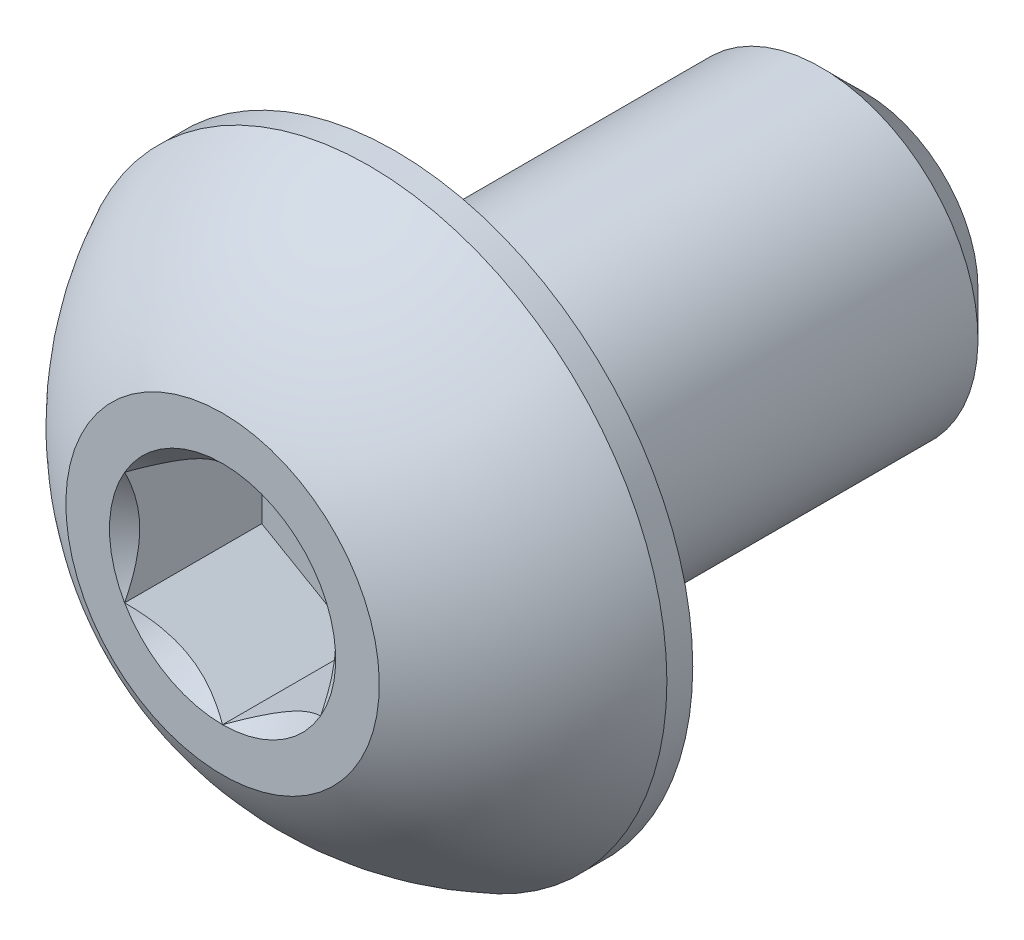
ISO-10303-21;
HEADER;
FILE_DESCRIPTION(('STEP AP214'),'2;1');
FILE_NAME('part.step','',(''),(''),'','','');
FILE_SCHEMA(('AUTOMOTIVE_DESIGN { 1 0 10303 214 1 1 1 1 }'));
ENDSEC;
DATA;
#1=APPLICATION_CONTEXT('core data for automotive mechanical design processes');
#2=APPLICATION_PROTOCOL_DEFINITION('international standard','automotive_design',2000,#1);
#3=PRODUCT_CONTEXT('',#1,'mechanical');
#4=PRODUCT('Part','Part','',(#3));
#5=PRODUCT_RELATED_PRODUCT_CATEGORY('part','',(#4));
#6=PRODUCT_DEFINITION_FORMATION('','',#4);
#7=PRODUCT_DEFINITION_CONTEXT('part definition',#1,'design');
#8=PRODUCT_DEFINITION('design','',#6,#7);
#9=PRODUCT_DEFINITION_SHAPE('','',#8);
#10=(LENGTH_UNIT() NAMED_UNIT(*) SI_UNIT(.MILLI.,.METRE.));
#11=(NAMED_UNIT(*) PLANE_ANGLE_UNIT() SI_UNIT($,.RADIAN.));
#12=(NAMED_UNIT(*) SI_UNIT($,.STERADIAN.) SOLID_ANGLE_UNIT());
#13=UNCERTAINTY_MEASURE_WITH_UNIT(LENGTH_MEASURE(1.E-05),#10,'distance_accuracy_value','');
#14=(GEOMETRIC_REPRESENTATION_CONTEXT(3) GLOBAL_UNCERTAINTY_ASSIGNED_CONTEXT((#13)) GLOBAL_UNIT_ASSIGNED_CONTEXT((#10,
#11,#12)) REPRESENTATION_CONTEXT('',''));
#15=CARTESIAN_POINT('',(0.,0.,0.));
#16=DIRECTION('',(0.,0.,1.));
#17=DIRECTION('',(1.,0.,0.));
#18=AXIS2_PLACEMENT_3D('',#15,#16,#17);
#19=CARTESIAN_POINT('',(0.,0.,4.1));
#20=DIRECTION('',(0.,0.,-1.));
#21=DIRECTION('',(0.,1.,0.));
#22=AXIS2_PLACEMENT_3D('',#19,#20,#21);
#23=PLANE('',#22);
#24=CARTESIAN_POINT('',(0.,0.,4.1));
#25=DIRECTION('',(0.,0.,1.));
#26=DIRECTION('',(1.,0.,0.));
#27=AXIS2_PLACEMENT_3D('',#24,#25,#26);
#28=CIRCLE('',#27,1.44337567297406);
#29=CARTESIAN_POINT('',(0.,1.44337567297406,4.1));
#30=VERTEX_POINT('',#29);
#31=CARTESIAN_POINT('',(-1.25,0.721687836487033,4.1));
#32=VERTEX_POINT('',#31);
#33=EDGE_CURVE('E214',#30,#32,#28,.T.);
#34=ORIENTED_EDGE('',*,*,#33,.F.);
#35=CARTESIAN_POINT('',(1.25,0.721687836487032,4.1));
#36=VERTEX_POINT('',#35);
#37=EDGE_CURVE('E216',#36,#30,#28,.T.);
#38=ORIENTED_EDGE('',*,*,#37,.F.);
#39=CARTESIAN_POINT('',(1.25,-0.721687836487032,4.1));
#40=VERTEX_POINT('',#39);
#41=EDGE_CURVE('E54',#40,#36,#28,.T.);
#42=ORIENTED_EDGE('',*,*,#41,.F.);
#43=CARTESIAN_POINT('',(0.,-1.44337567297406,4.1));
#44=VERTEX_POINT('',#43);
#45=EDGE_CURVE('E61',#44,#40,#28,.T.);
#46=ORIENTED_EDGE('',*,*,#45,.F.);
#47=CARTESIAN_POINT('',(-1.25,-0.721687836487033,4.1));
#48=VERTEX_POINT('',#47);
#49=EDGE_CURVE('E221',#48,#44,#28,.T.);
#50=ORIENTED_EDGE('',*,*,#49,.F.);
#51=EDGE_CURVE('E218',#32,#48,#28,.T.);
#52=ORIENTED_EDGE('',*,*,#51,.F.);
#53=EDGE_LOOP('',(#34,#38,#42,#46,#50,#52));
#54=FACE_BOUND('',#53,.T.);
#55=CARTESIAN_POINT('',(0.,0.,4.1));
#56=DIRECTION('',(0.,0.,1.));
#57=DIRECTION('',(0.,-1.,0.));
#58=AXIS2_PLACEMENT_3D('',#55,#56,#57);
#59=CIRCLE('',#58,2.);
#60=CARTESIAN_POINT('',(0.,2.,4.1));
#61=VERTEX_POINT('',#60);
#62=EDGE_CURVE('E48',#61,#61,#59,.T.);
#63=ORIENTED_EDGE('',*,*,#62,.T.);
#64=EDGE_LOOP('',(#63));
#65=FACE_BOUND('',#64,.T.);
#66=ADVANCED_FACE('F35',(#54,#65),#23,.F.);
#67=CARTESIAN_POINT('',(0.,0.,0.373556149732619));
#68=DIRECTION('',(0.,0.,1.));
#69=DIRECTION('',(0.,1.,0.));
#70=AXIS2_PLACEMENT_3D('',#67,#68,#69);
#71=SPHERICAL_SURFACE('',#70,4.22922968981298);
#72=CARTESIAN_POINT('',(0.,0.,2.23));
#73=DIRECTION('',(0.,0.,1.));
#74=DIRECTION('',(0.,-1.,0.));
#75=AXIS2_PLACEMENT_3D('',#72,#73,#74);
#76=CIRCLE('',#75,3.8);
#77=CARTESIAN_POINT('',(0.,3.8,2.23));
#78=VERTEX_POINT('',#77);
#79=EDGE_CURVE('E160',#78,#78,#76,.T.);
#80=CARTESIAN_POINT('',(0.,2.,4.1));
#81=CARTESIAN_POINT('',(0.,2.02421343985613,4.08700457403551));
#82=CARTESIAN_POINT('',(0.,2.04830018323974,4.07377308703487));
#83=CARTESIAN_POINT('',(0.,2.09621120342125,4.04684315849425));
#84=CARTESIAN_POINT('',(0.,2.12003548021917,4.03314471695428));
#85=CARTESIAN_POINT('',(0.,2.16741249358867,4.00528604686797));
#86=CARTESIAN_POINT('',(0.,2.19096523016025,3.99112581832164));
#87=CARTESIAN_POINT('',(0.,2.23779021933682,3.96234896476404));
#88=CARTESIAN_POINT('',(0.,2.2610624719418,3.94773233975278));
#89=CARTESIAN_POINT('',(0.,2.30731764886071,3.91804824448586));
#90=CARTESIAN_POINT('',(0.,2.33030057317465,3.90298077423021));
#91=CARTESIAN_POINT('',(0.,2.37596836104235,3.87240071441713));
#92=CARTESIAN_POINT('',(0.,2.39865322459612,3.85688812485971));
#93=CARTESIAN_POINT('',(0.,2.44371627121513,3.82542372060412));
#94=CARTESIAN_POINT('',(0.,2.46609445428037,3.80947190590595));
#95=CARTESIAN_POINT('',(0.,2.51053563686181,3.77713511266833));
#96=CARTESIAN_POINT('',(0.,2.532598636378,3.76075013412888));
#97=CARTESIAN_POINT('',(0.,2.57640106852492,3.72755323903277));
#98=CARTESIAN_POINT('',(0.,2.59814050115564,3.71074132247611));
#99=CARTESIAN_POINT('',(0.,2.64128753915153,3.67669693941185));
#100=CARTESIAN_POINT('',(0.,2.66269514451671,3.65946447290426));
#101=CARTESIAN_POINT('',(0.,2.70517039368395,3.62458553779703));
#102=CARTESIAN_POINT('',(0.,2.72623803748602,3.6069390691974));
#103=CARTESIAN_POINT('',(0.,2.76802535840618,3.57123883507559));
#104=CARTESIAN_POINT('',(0.,2.78874503552428,3.55318506955341));
#105=CARTESIAN_POINT('',(0.,2.82982855017313,3.51667710151719));
#106=CARTESIAN_POINT('',(0.,2.85019238770389,3.49822289900316));
#107=CARTESIAN_POINT('',(0.,2.89055648548394,3.46092106906898));
#108=CARTESIAN_POINT('',(0.,2.91055674573324,3.44207344164884));
#109=CARTESIAN_POINT('',(0.,2.95018608940553,3.40399192347874));
#110=CARTESIAN_POINT('',(0.,2.96981517282852,3.38475803272878));
#111=CARTESIAN_POINT('',(0.,3.00869470434027,3.34591129624471));
#112=CARTESIAN_POINT('',(0.,3.02794515242903,3.3262984505106));
#113=CARTESIAN_POINT('',(0.,3.06606009863533,3.28670125639628));
#114=CARTESIAN_POINT('',(0.,3.08492459675287,3.26671690801607));
#115=CARTESIAN_POINT('',(0.,3.12226047503002,3.22638430210832));
#116=CARTESIAN_POINT('',(0.,3.14073185518965,3.20603604458079));
#117=CARTESIAN_POINT('',(0.,3.17727447893821,3.16498335215256));
#118=CARTESIAN_POINT('',(0.,3.19534572252715,3.14427891725186));
#119=CARTESIAN_POINT('',(0.,3.23108120656242,3.10252173718901));
#120=CARTESIAN_POINT('',(0.,3.24874544700875,3.08146899202686));
#121=CARTESIAN_POINT('',(0.,3.28366021283673,3.03902319090103));
#122=CARTESIAN_POINT('',(0.,3.30091073821838,3.01763013493736));
#123=CARTESIAN_POINT('',(0.,3.33499151919534,2.97451184097717));
#124=CARTESIAN_POINT('',(0.,3.35182177479064,2.95278660298064));
#125=CARTESIAN_POINT('',(0.,3.38505562116371,2.9090121999432));
#126=CARTESIAN_POINT('',(0.,3.40145921194149,2.88696303490229));
#127=CARTESIAN_POINT('',(0.,3.43383349577047,2.84254915584848));
#128=CARTESIAN_POINT('',(0.,3.44980418882166,2.8201844418356));
#129=CARTESIAN_POINT('',(0.,3.48130660877275,2.77514796280767));
#130=CARTESIAN_POINT('',(0.,3.49683833567264,2.75247619779264));
#131=CARTESIAN_POINT('',(0.,3.52745692170931,2.70683423141033));
#132=CARTESIAN_POINT('',(0.,3.5425437808461,2.68386403004306));
#133=CARTESIAN_POINT('',(0.,3.57226689871518,2.63763391896935));
#134=CARTESIAN_POINT('',(0.,3.58690315744748,2.61437400926291));
#135=CARTESIAN_POINT('',(0.,3.61571951333199,2.56757331973341));
#136=CARTESIAN_POINT('',(0.,3.62989961048422,2.54403253991033));
#137=CARTESIAN_POINT('',(0.,3.65779825442823,2.4966790546141));
#138=CARTESIAN_POINT('',(0.,3.67151680122002,2.47286634914094));
#139=CARTESIAN_POINT('',(0.,3.69848713452321,2.42497806212234));
#140=CARTESIAN_POINT('',(0.,3.71173892103462,2.4009024805769));
#141=CARTESIAN_POINT('',(0.,3.73777068821038,2.35249758420785));
#142=CARTESIAN_POINT('',(0.,3.75055066887474,2.32816826938425));
#143=CARTESIAN_POINT('',(0.,3.77563400658954,2.27926517055481));
#144=CARTESIAN_POINT('',(0.,3.78793736363997,2.25469138654897));
#145=CARTESIAN_POINT('',(0.,3.8,2.23));
#146=B_SPLINE_CURVE_WITH_KNOTS('',3,(#80,#81,#82,#83,#84,#85,#86,#87,#88,#89,#90,#91,#92,#93,
#94,#95,#96,#97,#98,#99,#100,#101,#102,#103,#104,#105,#106,#107,#108,#109,#110,#111,#112,#113,
#114,#115,#116,#117,#118,#119,#120,#121,#122,#123,#124,#125,#126,#127,#128,#129,#130,#131,#132,
#133,#134,#135,#136,#137,#138,#139,#140,#141,#142,#143,#144,#145),.UNSPECIFIED.,.F.,.F.,(4,2,2,
2,2,2,2,2,2,2,2,2,2,2,2,2,2,2,2,2,2,2,2,2,2,2,2,2,2,2,2,2,4),(0.,0.0824398589102646,
0.164879717820529,0.247319576730794,0.329759435641058,0.412199294551323,0.494639153461587,
0.577079012371851,0.659518871282116,0.74195873019238,0.824398589102644,0.906838448012909,
0.989278306923173,1.07171816583344,1.1541580247437,1.23659788365397,1.31903774256423,
1.40147760147449,1.48391746038476,1.56635731929502,1.64879717820529,1.73123703711555,
1.81367689602582,1.89611675493608,1.97855661384635,2.06099647275661,2.14343633166687,
2.22587619057714,2.3083160494874,2.39075590839767,2.47319576730793,2.5556356262182,
2.63807548512846),.UNSPECIFIED.);
#147=EDGE_CURVE('BSEAM166',#61,#78,#146,.T.);
#148=ORIENTED_EDGE('',*,*,#62,.F.);
#149=ORIENTED_EDGE('',*,*,#79,.T.);
#150=ORIENTED_EDGE('',*,*,#147,.T.);
#151=ORIENTED_EDGE('',*,*,#147,.F.);
#152=EDGE_LOOP('',(#148,#150,#149,#151));
#153=FACE_BOUND('',#152,.T.);
#154=ADVANCED_FACE('F166',(#153),#71,.T.);
#155=CARTESIAN_POINT('',(0.,0.,4.1));
#156=DIRECTION('',(0.,0.,1.));
#157=DIRECTION('',(0.,-1.,0.));
#158=AXIS2_PLACEMENT_3D('',#155,#156,#157);
#159=CYLINDRICAL_SURFACE('',#158,3.8);
#160=ORIENTED_EDGE('',*,*,#79,.F.);
#161=EDGE_LOOP('',(#160));
#162=FACE_BOUND('',#161,.T.);
#163=CARTESIAN_POINT('',(0.,0.,1.9));
#164=DIRECTION('',(0.,0.,1.));
#165=DIRECTION('',(0.,-1.,0.));
#166=AXIS2_PLACEMENT_3D('',#163,#164,#165);
#167=CIRCLE('',#166,3.8);
#168=CARTESIAN_POINT('',(0.,-3.8,1.9));
#169=VERTEX_POINT('',#168);
#170=EDGE_CURVE('E157',#169,#169,#167,.T.);
#171=ORIENTED_EDGE('',*,*,#170,.T.);
#172=EDGE_LOOP('',(#171));
#173=FACE_BOUND('',#172,.T.);
#174=ADVANCED_FACE('F169',(#162,#173),#159,.T.);
#175=CARTESIAN_POINT('',(0.,2.,1.9));
#176=DIRECTION('',(0.,0.,1.));
#177=DIRECTION('',(0.,-1.,0.));
#178=AXIS2_PLACEMENT_3D('',#175,#176,#177);
#179=PLANE('',#178);
#180=ORIENTED_EDGE('',*,*,#170,.F.);
#181=EDGE_LOOP('',(#180));
#182=FACE_BOUND('',#181,.T.);
#183=CARTESIAN_POINT('',(0.,0.,1.9));
#184=DIRECTION('',(0.,0.,1.));
#185=DIRECTION('',(0.,-1.,0.));
#186=AXIS2_PLACEMENT_3D('',#183,#184,#185);
#187=CIRCLE('',#186,2.);
#188=CARTESIAN_POINT('',(0.,-2.,1.9));
#189=VERTEX_POINT('',#188);
#190=EDGE_CURVE('E154',#189,#189,#187,.T.);
#191=ORIENTED_EDGE('',*,*,#190,.T.);
#192=EDGE_LOOP('',(#191));
#193=FACE_BOUND('',#192,.T.);
#194=ADVANCED_FACE('F174',(#182,#193),#179,.F.);
#195=CARTESIAN_POINT('',(0.,0.,4.1));
#196=DIRECTION('',(0.,0.,1.));
#197=DIRECTION('',(0.,-1.,0.));
#198=AXIS2_PLACEMENT_3D('',#195,#196,#197);
#199=CYLINDRICAL_SURFACE('',#198,2.);
#200=ORIENTED_EDGE('',*,*,#190,.F.);
#201=EDGE_LOOP('',(#200));
#202=FACE_BOUND('',#201,.T.);
#203=CARTESIAN_POINT('',(0.,0.,-3.54));
#204=DIRECTION('',(0.,0.,1.));
#205=DIRECTION('',(0.,-1.,0.));
#206=AXIS2_PLACEMENT_3D('',#203,#204,#205);
#207=CIRCLE('',#206,2.);
#208=CARTESIAN_POINT('',(0.,-2.,-3.54));
#209=VERTEX_POINT('',#208);
#210=EDGE_CURVE('E151',#209,#209,#207,.T.);
#211=ORIENTED_EDGE('',*,*,#210,.T.);
#212=EDGE_LOOP('',(#211));
#213=FACE_BOUND('',#212,.T.);
#214=ADVANCED_FACE('F180',(#202,#213),#199,.T.);
#215=CARTESIAN_POINT('',(0.,0.,-4.1));
#216=DIRECTION('',(0.,0.,1.));
#217=DIRECTION('',(0.,-1.,0.));
#218=AXIS2_PLACEMENT_3D('',#215,#216,#217);
#219=CONICAL_SURFACE('',#218,1.44,0.785398163397445);
#220=ORIENTED_EDGE('',*,*,#210,.F.);
#221=EDGE_LOOP('',(#220));
#222=FACE_BOUND('',#221,.T.);
#223=CARTESIAN_POINT('',(0.,0.,-4.1));
#224=DIRECTION('',(0.,0.,1.));
#225=DIRECTION('',(0.,-1.,0.));
#226=AXIS2_PLACEMENT_3D('',#223,#224,#225);
#227=CIRCLE('',#226,1.44);
#228=CARTESIAN_POINT('',(0.,-1.44,-4.1));
#229=VERTEX_POINT('',#228);
#230=EDGE_CURVE('E138',#229,#229,#227,.T.);
#231=ORIENTED_EDGE('',*,*,#230,.T.);
#232=EDGE_LOOP('',(#231));
#233=FACE_BOUND('',#232,.T.);
#234=ADVANCED_FACE('F186',(#222,#233),#219,.T.);
#235=CARTESIAN_POINT('',(0.,0.,-4.1));
#236=DIRECTION('',(0.,0.,1.));
#237=DIRECTION('',(0.,-1.,0.));
#238=AXIS2_PLACEMENT_3D('',#235,#236,#237);
#239=PLANE('',#238);
#240=ORIENTED_EDGE('',*,*,#230,.F.);
#241=EDGE_LOOP('',(#240));
#242=FACE_BOUND('',#241,.T.);
#243=ADVANCED_FACE('F192',(#242),#239,.F.);
#244=CARTESIAN_POINT('',(0.,0.,4.1));
#245=DIRECTION('',(0.,0.,1.));
#246=DIRECTION('',(1.,0.,0.));
#247=AXIS2_PLACEMENT_3D('',#244,#245,#246);
#248=CONICAL_SURFACE('',#247,1.44337567297406,0.78539816339745);
#249=ORIENTED_EDGE('',*,*,#33,.T.);
#250=CARTESIAN_POINT('',(0.000199999999999987,1.4434911430279,4.10011548390914));
#251=CARTESIAN_POINT('',(-0.0427751670715869,1.41867941875065,4.0753216680551));
#252=CARTESIAN_POINT('',(-0.0864690047459484,1.39345276980743,4.05198373441868));
#253=CARTESIAN_POINT('',(-0.175565930841942,1.34201263554194,4.00925200408454));
#254=CARTESIAN_POINT('',(-0.220977498357064,1.31579425481276,3.98988199236041));
#255=CARTESIAN_POINT('',(-0.31254782093526,1.26292610442246,3.95670048341348));
#256=CARTESIAN_POINT('',(-0.358683240175886,1.23628980770471,3.94280555905265));
#257=CARTESIAN_POINT('',(-0.451970080407593,1.18243062538508,3.92139728216064));
#258=CARTESIAN_POINT('',(-0.49911864913638,1.15520938653761,3.91386794156679));
#259=CARTESIAN_POINT('',(-0.580373556887253,1.10829684367467,3.9070744980507));
#260=CARTESIAN_POINT('',(-0.614374876627941,1.08866617256958,3.90606855910435));
#261=CARTESIAN_POINT('',(-0.682317764432478,1.04943932800611,3.90776141491132));
#262=CARTESIAN_POINT('',(-0.716259317655658,1.02984316311599,3.91046102721554));
#263=CARTESIAN_POINT('',(-0.7838148564575,0.990839954603499,3.91940893031638));
#264=CARTESIAN_POINT('',(-0.817428507286775,0.971433104248771,3.9256605258997));
#265=CARTESIAN_POINT('',(-0.884094638217813,0.932943395609905,3.9413756814139));
#266=CARTESIAN_POINT('',(-0.917146871030296,0.913860680098301,3.95084062008746));
#267=CARTESIAN_POINT('',(-1.00179969160026,0.864986351354568,3.97893139068759));
#268=CARTESIAN_POINT('',(-1.05286649242964,0.835502920149076,3.9996701574522));
#269=CARTESIAN_POINT('',(-1.15300085411325,0.777690319475909,4.04638713467148));
#270=CARTESIAN_POINT('',(-1.20207431157827,0.749357745598417,4.07234829594677));
#271=CARTESIAN_POINT('',(-1.2502,0.721572366433195,4.10011548390914));
#272=B_SPLINE_CURVE_WITH_KNOTS('',3,(#250,#251,#252,#253,#254,#255,#256,#257,#258,#259,#260,
#261,#262,#263,#264,#265,#266,#267,#268,#269,#270,#271),.UNSPECIFIED.,.F.,.F.,(4,2,2,2,2,2,2,2,
2,2,4),(0.,0.166533409618304,0.334037607289762,0.498880396489699,0.663307919240275,
0.780963963458827,0.898645970148453,1.01643764860773,1.1342799317155,1.32148652032141,
1.50809158792573),.UNSPECIFIED.);
#273=EDGE_CURVE('E11',#30,#32,#272,.T.);
#274=ORIENTED_EDGE('',*,*,#273,.F.);
#275=EDGE_LOOP('',(#249,#274));
#276=FACE_BOUND('',#275,.T.);
#277=ADVANCED_FACE('F197',(#276),#248,.F.);
#278=ORIENTED_EDGE('',*,*,#51,.T.);
#279=CARTESIAN_POINT('',(-1.25,-1.43934010808077,4.56298209689233));
#280=CARTESIAN_POINT('',(-1.25,-1.40429313005659,4.53652492263289));
#281=CARTESIAN_POINT('',(-1.25,-1.36905087135599,4.51032716035428));
#282=CARTESIAN_POINT('',(-1.25,-1.29809650706311,4.45855757183958));
#283=CARTESIAN_POINT('',(-1.25,-1.26238428576495,4.43298590435629));
#284=CARTESIAN_POINT('',(-1.25,-1.15390111792708,4.35700599368946));
#285=CARTESIAN_POINT('',(-1.25,-1.08031646726264,4.30774028618957));
#286=CARTESIAN_POINT('',(-1.25,-0.926012322755095,4.21102583026313));
#287=CARTESIAN_POINT('',(-1.25,-0.845125318656146,4.16384129894179));
#288=CARTESIAN_POINT('',(-1.25,-0.679311174076602,4.07753073439041));
#289=CARTESIAN_POINT('',(-1.25,-0.594398891026687,4.0383775346269));
#290=CARTESIAN_POINT('',(-1.25,-0.46694481246074,3.99047722368829));
#291=CARTESIAN_POINT('',(-1.25,-0.426289985812822,3.97672948978633));
#292=CARTESIAN_POINT('',(-1.25,-0.343998850091267,3.95249792745054));
#293=CARTESIAN_POINT('',(-1.25,-0.302362473614962,3.94201432386977));
#294=CARTESIAN_POINT('',(-1.25,-0.219052696285665,3.9250301617483));
#295=CARTESIAN_POINT('',(-1.25,-0.1773934284745,3.91846136047137));
#296=CARTESIAN_POINT('',(-1.25,-0.0936293693401924,3.90943505345776));
#297=CARTESIAN_POINT('',(-1.25,-0.0515246558543963,3.90697684099727));
#298=CARTESIAN_POINT('',(-1.25,0.0311890576306313,3.90635406201328));
#299=CARTESIAN_POINT('',(-1.25,0.0717969625499301,3.90803711684625));
#300=CARTESIAN_POINT('',(-1.25,0.152668636885197,3.91526827059791));
#301=CARTESIAN_POINT('',(-1.25,0.192932338835358,3.92081711041311));
#302=CARTESIAN_POINT('',(-1.25,0.273499879165295,3.93557103646495));
#303=CARTESIAN_POINT('',(-1.25,0.313792180618511,3.9448381759641));
#304=CARTESIAN_POINT('',(-1.25,0.393496413911457,3.96653617845735));
#305=CARTESIAN_POINT('',(-1.25,0.432908419115059,3.97896677673064));
#306=CARTESIAN_POINT('',(-1.25,0.556992735862298,4.02277935293144));
#307=CARTESIAN_POINT('',(-1.25,0.639898924666085,4.05915107287596));
#308=CARTESIAN_POINT('',(-1.25,0.801816555499701,4.14001916217833));
#309=CARTESIAN_POINT('',(-1.25,0.880812666325045,4.18454472091199));
#310=CARTESIAN_POINT('',(-1.25,1.0317856127975,4.27640487666662));
#311=CARTESIAN_POINT('',(-1.25,1.10391618485086,4.32348993391625));
#312=CARTESIAN_POINT('',(-1.25,1.2101860604331,4.39627856159854));
#313=CARTESIAN_POINT('',(-1.25,1.24515069969379,4.42079808539336));
#314=CARTESIAN_POINT('',(-1.25,1.31460220852736,4.47048563676568));
#315=CARTESIAN_POINT('',(-1.25,1.34908920596618,4.49565348541552));
#316=CARTESIAN_POINT('',(-1.25,1.38337731682912,4.52109014884121));
#317=B_SPLINE_CURVE_WITH_KNOTS('',3,(#279,#280,#281,#282,#283,#284,#285,#286,#287,#288,#289,
#290,#291,#292,#293,#294,#295,#296,#297,#298,#299,#300,#301,#302,#303,#304,#305,#306,#307,#308,
#309,#310,#311,#312,#313,#314,#315,#316),.UNSPECIFIED.,.F.,.F.,(4,2,2,2,2,2,2,2,2,2,2,2,2,2,2,2,
2,2,4),(0.,0.131732960381448,0.263498984161645,0.529042014455825,0.809741926134618,
1.08947609717225,1.21811634272576,1.346765447839,1.47310084517844,1.59941451973784,
1.72115042167849,1.84290966131735,1.96679153905342,2.09066305366039,2.36146692896009,
2.63325989198491,2.89154668212279,3.01965734507713,3.14773302245628),.UNSPECIFIED.);
#318=EDGE_CURVE('E220',#32,#48,#317,.F.);
#319=ORIENTED_EDGE('',*,*,#318,.F.);
#320=EDGE_LOOP('',(#278,#319));
#321=FACE_BOUND('',#320,.T.);
#322=ADVANCED_FACE('F203',(#321),#248,.F.);
#323=ORIENTED_EDGE('',*,*,#49,.T.);
#324=CARTESIAN_POINT('',(-1.2502,-0.721572366433194,4.10011548390913));
#325=CARTESIAN_POINT('',(-1.20722483292841,-0.746384090710444,4.0753216680551));
#326=CARTESIAN_POINT('',(-1.16353099525405,-0.771610739653664,4.05198373441868));
#327=CARTESIAN_POINT('',(-1.07443406915806,-0.823050873919154,4.00925200408454));
#328=CARTESIAN_POINT('',(-1.02902250164294,-0.849269254648333,3.98988199236041));
#329=CARTESIAN_POINT('',(-0.937452179064741,-0.902137405038635,3.95670048341348));
#330=CARTESIAN_POINT('',(-0.891316759824115,-0.928773701756387,3.94280555905265));
#331=CARTESIAN_POINT('',(-0.798029919592408,-0.982632884076012,3.92139728216064));
#332=CARTESIAN_POINT('',(-0.750881350863621,-1.00985412292348,3.91386794156679));
#333=CARTESIAN_POINT('',(-0.669626443112749,-1.05676666578643,3.9070744980507));
#334=CARTESIAN_POINT('',(-0.63562512337206,-1.07639733689152,3.90606855910435));
#335=CARTESIAN_POINT('',(-0.567682235567524,-1.11562418145499,3.90776141491132));
#336=CARTESIAN_POINT('',(-0.533740682344343,-1.1352203463451,3.91046102721554));
#337=CARTESIAN_POINT('',(-0.466185143542501,-1.1742235548576,3.91940893031638));
#338=CARTESIAN_POINT('',(-0.432571492713226,-1.19363040521233,3.9256605258997));
#339=CARTESIAN_POINT('',(-0.365905361782188,-1.23212011385119,3.9413756814139));
#340=CARTESIAN_POINT('',(-0.332853128969705,-1.2512028293628,3.95084062008746));
#341=CARTESIAN_POINT('',(-0.248200308399737,-1.30007715810653,3.97893139068758));
#342=CARTESIAN_POINT('',(-0.197133507570363,-1.32956058931202,3.9996701574522));
#343=CARTESIAN_POINT('',(-0.0969991458867461,-1.38737318998519,4.04638713467148));
#344=CARTESIAN_POINT('',(-0.0479256884217311,-1.41570576386268,4.07234829594676));
#345=CARTESIAN_POINT('',(0.000199999999999777,-1.4434911430279,4.10011548390913));
#346=B_SPLINE_CURVE_WITH_KNOTS('',3,(#324,#325,#326,#327,#328,#329,#330,#331,#332,#333,#334,
#335,#336,#337,#338,#339,#340,#341,#342,#343,#344,#345),.UNSPECIFIED.,.F.,.F.,(4,2,2,2,2,2,2,2,
2,2,4),(0.,0.166533409618303,0.334037607289761,0.498880396489697,0.663307919240273,
0.780963963458825,0.898645970148451,1.01643764860773,1.13427993171549,1.32148652032141,
1.50809158792573),.UNSPECIFIED.);
#347=EDGE_CURVE('E230',#48,#44,#346,.T.);
#348=ORIENTED_EDGE('',*,*,#347,.F.);
#349=EDGE_LOOP('',(#323,#348));
#350=FACE_BOUND('',#349,.T.);
#351=ADVANCED_FACE('F280',(#350),#248,.F.);
#352=ORIENTED_EDGE('',*,*,#45,.T.);
#353=CARTESIAN_POINT('',(-0.000200000000000272,-1.4434911430279,4.10011548390913));
#354=CARTESIAN_POINT('',(0.0427751670715864,-1.41867941875065,4.0753216680551));
#355=CARTESIAN_POINT('',(0.0864690047459478,-1.39345276980743,4.05198373441868));
#356=CARTESIAN_POINT('',(0.175565930841942,-1.34201263554194,4.00925200408454));
#357=CARTESIAN_POINT('',(0.220977498357063,-1.31579425481276,3.98988199236041));
#358=CARTESIAN_POINT('',(0.312547820935259,-1.26292610442246,3.95670048341348));
#359=CARTESIAN_POINT('',(0.358683240175885,-1.23628980770471,3.94280555905265));
#360=CARTESIAN_POINT('',(0.451970080407592,-1.18243062538508,3.92139728216064));
#361=CARTESIAN_POINT('',(0.499118649136379,-1.15520938653761,3.91386794156679));
#362=CARTESIAN_POINT('',(0.580373556887252,-1.10829684367467,3.9070744980507));
#363=CARTESIAN_POINT('',(0.61437487662794,-1.08866617256958,3.90606855910435));
#364=CARTESIAN_POINT('',(0.682317764432477,-1.04943932800611,3.90776141491132));
#365=CARTESIAN_POINT('',(0.716259317655657,-1.02984316311599,3.91046102721554));
#366=CARTESIAN_POINT('',(0.783814856457499,-0.990839954603499,3.91940893031638));
#367=CARTESIAN_POINT('',(0.817428507286774,-0.971433104248771,3.9256605258997));
#368=CARTESIAN_POINT('',(0.884094638217812,-0.932943395609905,3.9413756814139));
#369=CARTESIAN_POINT('',(0.917146871030295,-0.913860680098301,3.95084062008746));
#370=CARTESIAN_POINT('',(1.00179969160026,-0.864986351354568,3.97893139068758));
#371=CARTESIAN_POINT('',(1.05286649242964,-0.835502920149076,3.9996701574522));
#372=CARTESIAN_POINT('',(1.15300085411325,-0.777690319475908,4.04638713467148));
#373=CARTESIAN_POINT('',(1.20207431157827,-0.749357745598416,4.07234829594676));
#374=CARTESIAN_POINT('',(1.2502,-0.721572366433194,4.10011548390914));
#375=B_SPLINE_CURVE_WITH_KNOTS('',3,(#353,#354,#355,#356,#357,#358,#359,#360,#361,#362,#363,
#364,#365,#366,#367,#368,#369,#370,#371,#372,#373,#374),.UNSPECIFIED.,.F.,.F.,(4,2,2,2,2,2,2,2,
2,2,4),(0.,0.166533409618304,0.334037607289761,0.498880396489698,0.663307919240274,
0.780963963458826,0.898645970148452,1.01643764860773,1.13427993171549,1.32148652032141,
1.50809158792574),.UNSPECIFIED.);
#376=EDGE_CURVE('E268',#44,#40,#375,.T.);
#377=ORIENTED_EDGE('',*,*,#376,.F.);
#378=EDGE_LOOP('',(#352,#377));
#379=FACE_BOUND('',#378,.T.);
#380=ADVANCED_FACE('F281',(#379),#248,.F.);
#381=ORIENTED_EDGE('',*,*,#41,.T.);
#382=CARTESIAN_POINT('',(1.25,-1.43934010808077,4.56298209689233));
#383=CARTESIAN_POINT('',(1.25,-1.40429313005659,4.53652492263289));
#384=CARTESIAN_POINT('',(1.25,-1.36905087135599,4.51032716035428));
#385=CARTESIAN_POINT('',(1.25,-1.29809650706311,4.45855757183958));
#386=CARTESIAN_POINT('',(1.25,-1.26238428576495,4.43298590435629));
#387=CARTESIAN_POINT('',(1.25,-1.15390111792708,4.35700599368946));
#388=CARTESIAN_POINT('',(1.25,-1.08031646726264,4.30774028618957));
#389=CARTESIAN_POINT('',(1.25,-0.926012322755096,4.21102583026313));
#390=CARTESIAN_POINT('',(1.25,-0.845125318656147,4.1638412989418));
#391=CARTESIAN_POINT('',(1.25,-0.679311174076602,4.07753073439041));
#392=CARTESIAN_POINT('',(1.25,-0.594398891026688,4.0383775346269));
#393=CARTESIAN_POINT('',(1.25,-0.46694481246074,3.99047722368829));
#394=CARTESIAN_POINT('',(1.25,-0.426289985812821,3.97672948978633));
#395=CARTESIAN_POINT('',(1.25,-0.343998850091267,3.95249792745054));
#396=CARTESIAN_POINT('',(1.25,-0.302362473614962,3.94201432386977));
#397=CARTESIAN_POINT('',(1.25,-0.219052696285665,3.9250301617483));
#398=CARTESIAN_POINT('',(1.25,-0.177393428474499,3.91846136047137));
#399=CARTESIAN_POINT('',(1.25,-0.0936293693401917,3.90943505345776));
#400=CARTESIAN_POINT('',(1.25,-0.0515246558543956,3.90697684099727));
#401=CARTESIAN_POINT('',(1.25,0.0311890576306319,3.90635406201328));
#402=CARTESIAN_POINT('',(1.25,0.0717969625499307,3.90803711684624));
#403=CARTESIAN_POINT('',(1.25,0.152668636885197,3.91526827059791));
#404=CARTESIAN_POINT('',(1.25,0.192932338835358,3.92081711041311));
#405=CARTESIAN_POINT('',(1.25,0.273499879165296,3.93557103646495));
#406=CARTESIAN_POINT('',(1.25,0.313792180618511,3.94483817596411));
#407=CARTESIAN_POINT('',(1.25,0.393496413911458,3.96653617845735));
#408=CARTESIAN_POINT('',(1.25,0.432908419115059,3.97896677673064));
#409=CARTESIAN_POINT('',(1.25,0.556992735862298,4.02277935293144));
#410=CARTESIAN_POINT('',(1.25,0.639898924666086,4.05915107287596));
#411=CARTESIAN_POINT('',(1.25,0.801816555499702,4.14001916217834));
#412=CARTESIAN_POINT('',(1.25,0.880812666325046,4.18454472091199));
#413=CARTESIAN_POINT('',(1.25,1.0317856127975,4.27640487666662));
#414=CARTESIAN_POINT('',(1.25,1.10391618485086,4.32348993391625));
#415=CARTESIAN_POINT('',(1.25,1.21018606043311,4.39627856159854));
#416=CARTESIAN_POINT('',(1.25,1.2451506996938,4.42079808539336));
#417=CARTESIAN_POINT('',(1.25,1.31460220852737,4.47048563676568));
#418=CARTESIAN_POINT('',(1.25,1.34908920596618,4.49565348541552));
#419=CARTESIAN_POINT('',(1.25,1.38337731682912,4.52109014884121));
#420=B_SPLINE_CURVE_WITH_KNOTS('',3,(#382,#383,#384,#385,#386,#387,#388,#389,#390,#391,#392,
#393,#394,#395,#396,#397,#398,#399,#400,#401,#402,#403,#404,#405,#406,#407,#408,#409,#410,#411,
#412,#413,#414,#415,#416,#417,#418,#419),.UNSPECIFIED.,.F.,.F.,(4,2,2,2,2,2,2,2,2,2,2,2,2,2,2,2,
2,2,4),(0.,0.131732960381448,0.263498984161645,0.529042014455825,0.809741926134618,
1.08947609717225,1.21811634272577,1.346765447839,1.47310084517844,1.59941451973784,
1.72115042167849,1.84290966131735,1.96679153905342,2.09066305366039,2.36146692896009,
2.63325989198491,2.89154668212279,3.01965734507713,3.14773302245628),.UNSPECIFIED.);
#421=EDGE_CURVE('E120',#40,#36,#420,.T.);
#422=ORIENTED_EDGE('',*,*,#421,.F.);
#423=EDGE_LOOP('',(#381,#422));
#424=FACE_BOUND('',#423,.T.);
#425=ADVANCED_FACE('F283',(#424),#248,.F.);
#426=ORIENTED_EDGE('',*,*,#37,.T.);
#427=CARTESIAN_POINT('',(1.2502,0.721572366433194,4.10011548390914));
#428=CARTESIAN_POINT('',(1.20722483292841,0.746384090710444,4.0753216680551));
#429=CARTESIAN_POINT('',(1.16353099525405,0.771610739653665,4.05198373441868));
#430=CARTESIAN_POINT('',(1.07443406915806,0.823050873919155,4.00925200408454));
#431=CARTESIAN_POINT('',(1.02902250164294,0.849269254648333,3.98988199236041));
#432=CARTESIAN_POINT('',(0.93745217906474,0.902137405038635,3.95670048341348));
#433=CARTESIAN_POINT('',(0.891316759824114,0.928773701756387,3.94280555905265));
#434=CARTESIAN_POINT('',(0.798029919592408,0.982632884076012,3.92139728216064));
#435=CARTESIAN_POINT('',(0.75088135086362,1.00985412292348,3.91386794156679));
#436=CARTESIAN_POINT('',(0.669626443112748,1.05676666578643,3.9070744980507));
#437=CARTESIAN_POINT('',(0.63562512337206,1.07639733689152,3.90606855910435));
#438=CARTESIAN_POINT('',(0.567682235567523,1.11562418145499,3.90776141491132));
#439=CARTESIAN_POINT('',(0.533740682344343,1.1352203463451,3.91046102721554));
#440=CARTESIAN_POINT('',(0.466185143542501,1.1742235548576,3.91940893031638));
#441=CARTESIAN_POINT('',(0.432571492713226,1.19363040521233,3.9256605258997));
#442=CARTESIAN_POINT('',(0.365905361782188,1.23212011385119,3.9413756814139));
#443=CARTESIAN_POINT('',(0.332853128969705,1.2512028293628,3.95084062008746));
#444=CARTESIAN_POINT('',(0.248200308399736,1.30007715810653,3.97893139068758));
#445=CARTESIAN_POINT('',(0.197133507570362,1.32956058931202,3.9996701574522));
#446=CARTESIAN_POINT('',(0.0969991458867455,1.38737318998519,4.04638713467148));
#447=CARTESIAN_POINT('',(0.0479256884217308,1.41570576386268,4.07234829594677));
#448=CARTESIAN_POINT('',(-0.000200000000000095,1.4434911430279,4.10011548390913));
#449=B_SPLINE_CURVE_WITH_KNOTS('',3,(#427,#428,#429,#430,#431,#432,#433,#434,#435,#436,#437,
#438,#439,#440,#441,#442,#443,#444,#445,#446,#447,#448),.UNSPECIFIED.,.F.,.F.,(4,2,2,2,2,2,2,2,
2,2,4),(0.,0.166533409618304,0.334037607289762,0.498880396489698,0.663307919240274,
0.780963963458826,0.898645970148452,1.01643764860773,1.13427993171549,1.32148652032141,
1.50809158792574),.UNSPECIFIED.);
#450=EDGE_CURVE('E101',#36,#30,#449,.T.);
#451=ORIENTED_EDGE('',*,*,#450,.F.);
#452=EDGE_LOOP('',(#426,#451));
#453=FACE_BOUND('',#452,.T.);
#454=ADVANCED_FACE('F205',(#453),#248,.F.);
#455=CARTESIAN_POINT('',(0.,0.,2.35));
#456=DIRECTION('',(0.,0.,1.));
#457=DIRECTION('',(1.,0.,0.));
#458=AXIS2_PLACEMENT_3D('',#455,#456,#457);
#459=PLANE('',#458);
#460=DIRECTION('',(-0.866025403784439,0.5,0.));
#461=VECTOR('',#460,1.);
#462=CARTESIAN_POINT('',(1.25,0.721687836487032,2.35));
#463=LINE('',#462,#461);
#464=CARTESIAN_POINT('',(1.25,0.721687836487032,2.35));
#465=VERTEX_POINT('',#464);
#466=CARTESIAN_POINT('',(0.,1.44337567297406,2.35));
#467=VERTEX_POINT('',#466);
#468=EDGE_CURVE('E99',#465,#467,#463,.T.);
#469=ORIENTED_EDGE('',*,*,#468,.T.);
#470=DIRECTION('',(-0.866025403784439,-0.5,0.));
#471=VECTOR('',#470,1.);
#472=CARTESIAN_POINT('',(0.,1.44337567297406,2.35));
#473=LINE('',#472,#471);
#474=CARTESIAN_POINT('',(-1.25,0.721687836487033,2.35));
#475=VERTEX_POINT('',#474);
#476=EDGE_CURVE('E108',#467,#475,#473,.T.);
#477=ORIENTED_EDGE('',*,*,#476,.T.);
#478=DIRECTION('',(0.,-1.,0.));
#479=VECTOR('',#478,1.);
#480=CARTESIAN_POINT('',(-1.25,0.721687836487033,2.35));
#481=LINE('',#480,#479);
#482=CARTESIAN_POINT('',(-1.25,-0.721687836487032,2.35));
#483=VERTEX_POINT('',#482);
#484=EDGE_CURVE('E114',#475,#483,#481,.T.);
#485=ORIENTED_EDGE('',*,*,#484,.T.);
#486=DIRECTION('',(0.866025403784439,-0.5,0.));
#487=VECTOR('',#486,1.);
#488=CARTESIAN_POINT('',(-1.25,-0.721687836487032,2.35));
#489=LINE('',#488,#487);
#490=CARTESIAN_POINT('',(0.,-1.44337567297406,2.35));
#491=VERTEX_POINT('',#490);
#492=EDGE_CURVE('E130',#483,#491,#489,.T.);
#493=ORIENTED_EDGE('',*,*,#492,.T.);
#494=DIRECTION('',(0.866025403784439,0.5,0.));
#495=VECTOR('',#494,1.);
#496=CARTESIAN_POINT('',(0.,-1.44337567297406,2.35));
#497=LINE('',#496,#495);
#498=CARTESIAN_POINT('',(1.25,-0.721687836487032,2.35));
#499=VERTEX_POINT('',#498);
#500=EDGE_CURVE('E133',#491,#499,#497,.T.);
#501=ORIENTED_EDGE('',*,*,#500,.T.);
#502=DIRECTION('',(0.,1.,0.));
#503=VECTOR('',#502,1.);
#504=CARTESIAN_POINT('',(1.25,-0.721687836487032,2.35));
#505=LINE('',#504,#503);
#506=EDGE_CURVE('E105',#499,#465,#505,.T.);
#507=ORIENTED_EDGE('',*,*,#506,.T.);
#508=EDGE_LOOP('',(#469,#477,#485,#493,#501,#507));
#509=FACE_BOUND('',#508,.T.);
#510=ADVANCED_FACE('F116',(#509),#459,.T.);
#511=CARTESIAN_POINT('',(0.,1.44337567297406,2.35));
#512=DIRECTION('',(-0.5,0.866025403784439,0.));
#513=DIRECTION('',(-0.866025403784439,-0.5,0.));
#514=AXIS2_PLACEMENT_3D('',#511,#512,#513);
#515=PLANE('',#514);
#516=DIRECTION('',(0.,0.,1.));
#517=VECTOR('',#516,1.);
#518=CARTESIAN_POINT('',(0.,1.44337567297406,2.35));
#519=LINE('',#518,#517);
#520=EDGE_CURVE('E94',#467,#30,#519,.T.);
#521=ORIENTED_EDGE('',*,*,#520,.T.);
#522=ORIENTED_EDGE('',*,*,#273,.T.);
#523=DIRECTION('',(0.,0.,1.));
#524=VECTOR('',#523,1.);
#525=CARTESIAN_POINT('',(-1.25,0.721687836487033,2.35));
#526=LINE('',#525,#524);
#527=EDGE_CURVE('E104',#475,#32,#526,.T.);
#528=ORIENTED_EDGE('',*,*,#527,.F.);
#529=ORIENTED_EDGE('',*,*,#476,.F.);
#530=EDGE_LOOP('',(#521,#522,#528,#529));
#531=FACE_BOUND('',#530,.T.);
#532=ADVANCED_FACE('F109',(#531),#515,.F.);
#533=CARTESIAN_POINT('',(-1.25,0.721687836487033,2.35));
#534=DIRECTION('',(-1.,0.,0.));
#535=DIRECTION('',(0.,0.,1.));
#536=AXIS2_PLACEMENT_3D('',#533,#534,#535);
#537=PLANE('',#536);
#538=ORIENTED_EDGE('',*,*,#527,.T.);
#539=ORIENTED_EDGE('',*,*,#318,.T.);
#540=DIRECTION('',(0.,0.,1.));
#541=VECTOR('',#540,1.);
#542=CARTESIAN_POINT('',(-1.25,-0.721687836487032,2.35));
#543=LINE('',#542,#541);
#544=EDGE_CURVE('E145',#483,#48,#543,.T.);
#545=ORIENTED_EDGE('',*,*,#544,.F.);
#546=ORIENTED_EDGE('',*,*,#484,.F.);
#547=EDGE_LOOP('',(#538,#539,#545,#546));
#548=FACE_BOUND('',#547,.T.);
#549=ADVANCED_FACE('F239',(#548),#537,.F.);
#550=CARTESIAN_POINT('',(-1.25,-0.721687836487032,2.35));
#551=DIRECTION('',(-0.5,-0.866025403784438,0.));
#552=DIRECTION('',(0.866025403784439,-0.5,0.));
#553=AXIS2_PLACEMENT_3D('',#550,#551,#552);
#554=PLANE('',#553);
#555=ORIENTED_EDGE('',*,*,#544,.T.);
#556=ORIENTED_EDGE('',*,*,#347,.T.);
#557=DIRECTION('',(0.,0.,1.));
#558=VECTOR('',#557,1.);
#559=CARTESIAN_POINT('',(0.,-1.44337567297406,2.35));
#560=LINE('',#559,#558);
#561=EDGE_CURVE('E142',#491,#44,#560,.T.);
#562=ORIENTED_EDGE('',*,*,#561,.F.);
#563=ORIENTED_EDGE('',*,*,#492,.F.);
#564=EDGE_LOOP('',(#555,#556,#562,#563));
#565=FACE_BOUND('',#564,.T.);
#566=ADVANCED_FACE('F242',(#565),#554,.F.);
#567=CARTESIAN_POINT('',(0.,-1.44337567297406,2.35));
#568=DIRECTION('',(0.5,-0.866025403784439,0.));
#569=DIRECTION('',(0.866025403784439,0.5,0.));
#570=AXIS2_PLACEMENT_3D('',#567,#568,#569);
#571=PLANE('',#570);
#572=ORIENTED_EDGE('',*,*,#561,.T.);
#573=ORIENTED_EDGE('',*,*,#376,.T.);
#574=DIRECTION('',(0.,0.,1.));
#575=VECTOR('',#574,1.);
#576=CARTESIAN_POINT('',(1.25,-0.721687836487032,2.35));
#577=LINE('',#576,#575);
#578=EDGE_CURVE('E139',#499,#40,#577,.T.);
#579=ORIENTED_EDGE('',*,*,#578,.F.);
#580=ORIENTED_EDGE('',*,*,#500,.F.);
#581=EDGE_LOOP('',(#572,#573,#579,#580));
#582=FACE_BOUND('',#581,.T.);
#583=ADVANCED_FACE('F254',(#582),#571,.F.);
#584=CARTESIAN_POINT('',(1.25,-0.721687836487032,2.35));
#585=DIRECTION('',(1.,0.,0.));
#586=DIRECTION('',(0.,1.,0.));
#587=AXIS2_PLACEMENT_3D('',#584,#585,#586);
#588=PLANE('',#587);
#589=ORIENTED_EDGE('',*,*,#578,.T.);
#590=ORIENTED_EDGE('',*,*,#421,.T.);
#591=DIRECTION('',(0.,0.,1.));
#592=VECTOR('',#591,1.);
#593=CARTESIAN_POINT('',(1.25,0.721687836487032,2.35));
#594=LINE('',#593,#592);
#595=EDGE_CURVE('E136',#465,#36,#594,.T.);
#596=ORIENTED_EDGE('',*,*,#595,.F.);
#597=ORIENTED_EDGE('',*,*,#506,.F.);
#598=EDGE_LOOP('',(#589,#590,#596,#597));
#599=FACE_BOUND('',#598,.T.);
#600=ADVANCED_FACE('F250',(#599),#588,.F.);
#601=CARTESIAN_POINT('',(1.25,0.721687836487032,2.35));
#602=DIRECTION('',(0.5,0.866025403784438,0.));
#603=DIRECTION('',(-0.866025403784439,0.5,0.));
#604=AXIS2_PLACEMENT_3D('',#601,#602,#603);
#605=PLANE('',#604);
#606=ORIENTED_EDGE('',*,*,#595,.T.);
#607=ORIENTED_EDGE('',*,*,#450,.T.);
#608=ORIENTED_EDGE('',*,*,#520,.F.);
#609=ORIENTED_EDGE('',*,*,#468,.F.);
#610=EDGE_LOOP('',(#606,#607,#608,#609));
#611=FACE_BOUND('',#610,.T.);
#612=ADVANCED_FACE('F97',(#611),#605,.F.);
#613=CLOSED_SHELL('',(#66,#154,#174,#194,#214,#234,#243,#277,#322,#351,#380,#425,#454,#510,#532,
#549,#566,#583,#600,#612));
#614=MANIFOLD_SOLID_BREP('B2',#613);
#615=ADVANCED_BREP_SHAPE_REPRESENTATION('',(#18,#614),#14);
#616=SHAPE_DEFINITION_REPRESENTATION(#9,#615);
ENDSEC;
END-ISO-10303-21;
